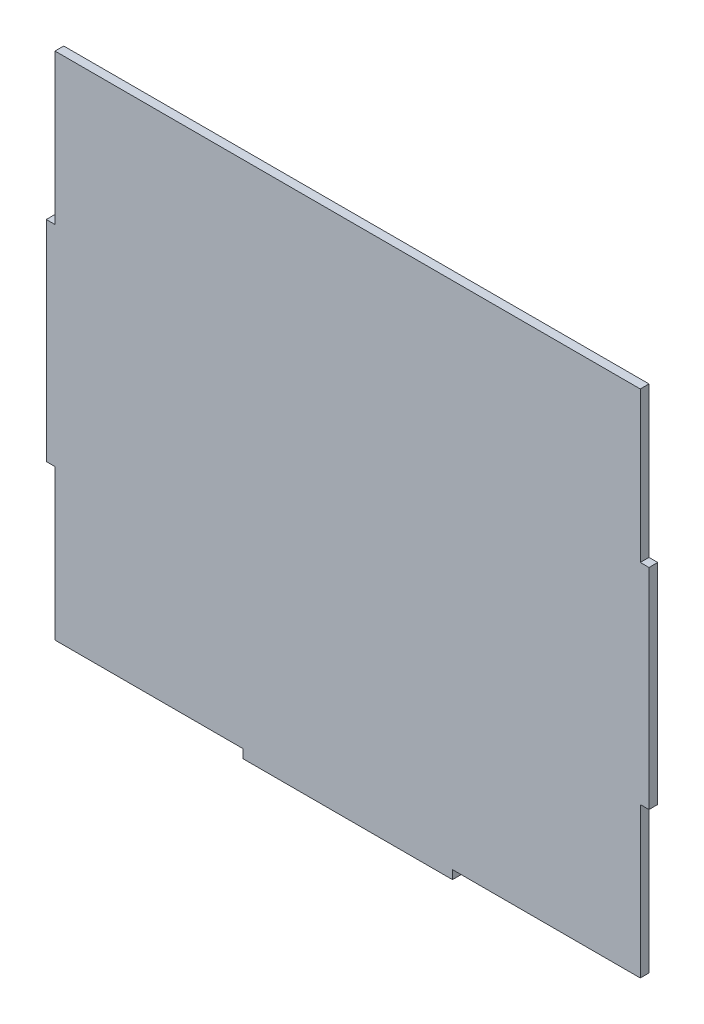
ISO-10303-21;
HEADER;
FILE_DESCRIPTION(('STEP AP214'),'2;1');
FILE_NAME('part.step','',(''),(''),'','','');
FILE_SCHEMA(('AUTOMOTIVE_DESIGN { 1 0 10303 214 1 1 1 1 }'));
ENDSEC;
DATA;
#1=APPLICATION_CONTEXT('core data for automotive mechanical design processes');
#2=APPLICATION_PROTOCOL_DEFINITION('international standard','automotive_design',2000,#1);
#3=PRODUCT_CONTEXT('',#1,'mechanical');
#4=PRODUCT('Part','Part','',(#3));
#5=PRODUCT_RELATED_PRODUCT_CATEGORY('part','',(#4));
#6=PRODUCT_DEFINITION_FORMATION('','',#4);
#7=PRODUCT_DEFINITION_CONTEXT('part definition',#1,'design');
#8=PRODUCT_DEFINITION('design','',#6,#7);
#9=PRODUCT_DEFINITION_SHAPE('','',#8);
#10=(LENGTH_UNIT() NAMED_UNIT(*) SI_UNIT(.MILLI.,.METRE.));
#11=(NAMED_UNIT(*) PLANE_ANGLE_UNIT() SI_UNIT($,.RADIAN.));
#12=(NAMED_UNIT(*) SI_UNIT($,.STERADIAN.) SOLID_ANGLE_UNIT());
#13=UNCERTAINTY_MEASURE_WITH_UNIT(LENGTH_MEASURE(1.E-05),#10,'distance_accuracy_value','');
#14=(GEOMETRIC_REPRESENTATION_CONTEXT(3) GLOBAL_UNCERTAINTY_ASSIGNED_CONTEXT((#13)) GLOBAL_UNIT_ASSIGNED_CONTEXT((#10,
#11,#12)) REPRESENTATION_CONTEXT('',''));
#15=CARTESIAN_POINT('',(0.,0.,0.));
#16=DIRECTION('',(0.,0.,1.));
#17=DIRECTION('',(1.,0.,0.));
#18=AXIS2_PLACEMENT_3D('',#15,#16,#17);
#19=CARTESIAN_POINT('',(-106.3625,-92.71,3.175));
#20=DIRECTION('',(0.,1.,0.));
#21=DIRECTION('',(0.,0.,1.));
#22=AXIS2_PLACEMENT_3D('',#19,#20,#21);
#23=PLANE('',#22);
#24=DIRECTION('',(0.,0.,-1.));
#25=VECTOR('',#24,1.);
#26=CARTESIAN_POINT('',(-38.1000000000002,-92.7099999999997,79.4411171490984));
#27=LINE('',#26,#25);
#28=CARTESIAN_POINT('',(-38.1000000000002,-92.7099999999997,3.175));
#29=VERTEX_POINT('',#28);
#30=CARTESIAN_POINT('',(-38.1000000000002,-92.7099999999997,0.));
#31=VERTEX_POINT('',#30);
#32=EDGE_CURVE('E176',#29,#31,#27,.T.);
#33=ORIENTED_EDGE('',*,*,#32,.F.);
#34=DIRECTION('',(1.,0.,0.));
#35=VECTOR('',#34,1.);
#36=CARTESIAN_POINT('',(-106.3625,-92.71,3.175));
#37=LINE('',#36,#35);
#38=CARTESIAN_POINT('',(-106.3625,-92.71,3.175));
#39=VERTEX_POINT('',#38);
#40=EDGE_CURVE('E241',#39,#29,#37,.T.);
#41=ORIENTED_EDGE('',*,*,#40,.F.);
#42=DIRECTION('',(0.,0.,-1.));
#43=VECTOR('',#42,1.);
#44=CARTESIAN_POINT('',(-106.3625,-92.71,3.175));
#45=LINE('',#44,#43);
#46=CARTESIAN_POINT('',(-106.3625,-92.71,0.));
#47=VERTEX_POINT('',#46);
#48=EDGE_CURVE('E259',#39,#47,#45,.T.);
#49=ORIENTED_EDGE('',*,*,#48,.T.);
#50=DIRECTION('',(1.,0.,0.));
#51=VECTOR('',#50,1.);
#52=CARTESIAN_POINT('',(-106.3625,-92.71,0.));
#53=LINE('',#52,#51);
#54=EDGE_CURVE('E254',#47,#31,#53,.T.);
#55=ORIENTED_EDGE('',*,*,#54,.T.);
#56=EDGE_LOOP('',(#33,#41,#49,#55));
#57=FACE_BOUND('',#56,.T.);
#58=ADVANCED_FACE('F34',(#57),#23,.F.);
#59=CARTESIAN_POINT('',(-106.3625,92.71,3.175));
#60=DIRECTION('',(1.,0.,0.));
#61=DIRECTION('',(0.,1.,0.));
#62=AXIS2_PLACEMENT_3D('',#59,#60,#61);
#63=PLANE('',#62);
#64=DIRECTION('',(0.,0.,-1.));
#65=VECTOR('',#64,1.);
#66=CARTESIAN_POINT('',(-106.3625,38.1,79.4411171490984));
#67=LINE('',#66,#65);
#68=CARTESIAN_POINT('',(-106.3625,38.1,3.175));
#69=VERTEX_POINT('',#68);
#70=CARTESIAN_POINT('',(-106.3625,38.1,0.));
#71=VERTEX_POINT('',#70);
#72=EDGE_CURVE('E194',#69,#71,#67,.T.);
#73=ORIENTED_EDGE('',*,*,#72,.F.);
#74=DIRECTION('',(0.,-1.,0.));
#75=VECTOR('',#74,1.);
#76=CARTESIAN_POINT('',(-106.3625,92.71,3.175));
#77=LINE('',#76,#75);
#78=CARTESIAN_POINT('',(-106.3625,92.71,3.175));
#79=VERTEX_POINT('',#78);
#80=EDGE_CURVE('E237',#79,#69,#77,.T.);
#81=ORIENTED_EDGE('',*,*,#80,.F.);
#82=DIRECTION('',(0.,0.,-1.));
#83=VECTOR('',#82,1.);
#84=CARTESIAN_POINT('',(-106.3625,92.71,3.175));
#85=LINE('',#84,#83);
#86=CARTESIAN_POINT('',(-106.3625,92.71,0.));
#87=VERTEX_POINT('',#86);
#88=EDGE_CURVE('E42',#79,#87,#85,.T.);
#89=ORIENTED_EDGE('',*,*,#88,.T.);
#90=DIRECTION('',(0.,-1.,0.));
#91=VECTOR('',#90,1.);
#92=CARTESIAN_POINT('',(-106.3625,92.71,0.));
#93=LINE('',#92,#91);
#94=EDGE_CURVE('E250',#87,#71,#93,.T.);
#95=ORIENTED_EDGE('',*,*,#94,.T.);
#96=EDGE_LOOP('',(#73,#81,#89,#95));
#97=FACE_BOUND('',#96,.T.);
#98=ADVANCED_FACE('F267',(#97),#63,.F.);
#99=CARTESIAN_POINT('',(106.3625,92.71,3.175));
#100=DIRECTION('',(-1.,0.,0.));
#101=DIRECTION('',(0.,-1.,0.));
#102=AXIS2_PLACEMENT_3D('',#99,#100,#101);
#103=PLANE('',#102);
#104=DIRECTION('',(0.,0.,-1.));
#105=VECTOR('',#104,1.);
#106=CARTESIAN_POINT('',(106.3625,-38.1,79.4411171490984));
#107=LINE('',#106,#105);
#108=CARTESIAN_POINT('',(106.3625,-38.1,3.175));
#109=VERTEX_POINT('',#108);
#110=CARTESIAN_POINT('',(106.3625,-38.1,0.));
#111=VERTEX_POINT('',#110);
#112=EDGE_CURVE('E215',#109,#111,#107,.T.);
#113=ORIENTED_EDGE('',*,*,#112,.F.);
#114=DIRECTION('',(0.,1.,0.));
#115=VECTOR('',#114,1.);
#116=CARTESIAN_POINT('',(106.3625,92.71,3.175));
#117=LINE('',#116,#115);
#118=CARTESIAN_POINT('',(106.3625,-92.71,3.175));
#119=VERTEX_POINT('',#118);
#120=EDGE_CURVE('E231',#119,#109,#117,.T.);
#121=ORIENTED_EDGE('',*,*,#120,.F.);
#122=DIRECTION('',(0.,0.,-1.));
#123=VECTOR('',#122,1.);
#124=CARTESIAN_POINT('',(106.3625,-92.71,3.175));
#125=LINE('',#124,#123);
#126=CARTESIAN_POINT('',(106.3625,-92.71,0.));
#127=VERTEX_POINT('',#126);
#128=EDGE_CURVE('E243',#119,#127,#125,.T.);
#129=ORIENTED_EDGE('',*,*,#128,.T.);
#130=DIRECTION('',(0.,1.,0.));
#131=VECTOR('',#130,1.);
#132=CARTESIAN_POINT('',(106.3625,92.71,0.));
#133=LINE('',#132,#131);
#134=EDGE_CURVE('E244',#127,#111,#133,.T.);
#135=ORIENTED_EDGE('',*,*,#134,.T.);
#136=EDGE_LOOP('',(#113,#121,#129,#135));
#137=FACE_BOUND('',#136,.T.);
#138=ADVANCED_FACE('F298',(#137),#103,.F.);
#139=CARTESIAN_POINT('',(106.3625,38.1,3.175));
#140=VERTEX_POINT('',#139);
#141=CARTESIAN_POINT('',(106.3625,92.71,3.175));
#142=VERTEX_POINT('',#141);
#143=EDGE_CURVE('E234',#140,#142,#117,.T.);
#144=ORIENTED_EDGE('',*,*,#143,.F.);
#145=DIRECTION('',(0.,0.,-1.));
#146=VECTOR('',#145,1.);
#147=CARTESIAN_POINT('',(106.3625,38.1,79.4411171490984));
#148=LINE('',#147,#146);
#149=CARTESIAN_POINT('',(106.3625,38.1,0.));
#150=VERTEX_POINT('',#149);
#151=EDGE_CURVE('E224',#140,#150,#148,.T.);
#152=ORIENTED_EDGE('',*,*,#151,.T.);
#153=CARTESIAN_POINT('',(106.3625,92.71,0.));
#154=VERTEX_POINT('',#153);
#155=EDGE_CURVE('E230',#150,#154,#133,.T.);
#156=ORIENTED_EDGE('',*,*,#155,.T.);
#157=DIRECTION('',(0.,0.,-1.));
#158=VECTOR('',#157,1.);
#159=CARTESIAN_POINT('',(106.3625,92.71,3.175));
#160=LINE('',#159,#158);
#161=EDGE_CURVE('E11',#142,#154,#160,.T.);
#162=ORIENTED_EDGE('',*,*,#161,.F.);
#163=EDGE_LOOP('',(#144,#152,#156,#162));
#164=FACE_BOUND('',#163,.T.);
#165=ADVANCED_FACE('F36',(#164),#103,.F.);
#166=CARTESIAN_POINT('',(-106.3625,92.71,3.175));
#167=DIRECTION('',(0.,-1.,0.));
#168=DIRECTION('',(0.,0.,-1.));
#169=AXIS2_PLACEMENT_3D('',#166,#167,#168);
#170=PLANE('',#169);
#171=DIRECTION('',(-1.,0.,0.));
#172=VECTOR('',#171,1.);
#173=CARTESIAN_POINT('',(-106.3625,92.71,0.));
#174=LINE('',#173,#172);
#175=EDGE_CURVE('E247',#154,#87,#174,.T.);
#176=ORIENTED_EDGE('',*,*,#175,.T.);
#177=ORIENTED_EDGE('',*,*,#88,.F.);
#178=DIRECTION('',(-1.,0.,0.));
#179=VECTOR('',#178,1.);
#180=CARTESIAN_POINT('',(-106.3625,92.71,3.175));
#181=LINE('',#180,#179);
#182=EDGE_CURVE('E233',#142,#79,#181,.T.);
#183=ORIENTED_EDGE('',*,*,#182,.F.);
#184=ORIENTED_EDGE('',*,*,#161,.T.);
#185=EDGE_LOOP('',(#176,#177,#183,#184));
#186=FACE_BOUND('',#185,.T.);
#187=ADVANCED_FACE('F282',(#186),#170,.F.);
#188=CARTESIAN_POINT('',(-106.3625,-38.1,3.175));
#189=VERTEX_POINT('',#188);
#190=EDGE_CURVE('E236',#189,#39,#77,.T.);
#191=ORIENTED_EDGE('',*,*,#190,.F.);
#192=DIRECTION('',(0.,0.,-1.));
#193=VECTOR('',#192,1.);
#194=CARTESIAN_POINT('',(-106.3625,-38.1,79.4411171490984));
#195=LINE('',#194,#193);
#196=CARTESIAN_POINT('',(-106.3625,-38.1,0.));
#197=VERTEX_POINT('',#196);
#198=EDGE_CURVE('E200',#189,#197,#195,.T.);
#199=ORIENTED_EDGE('',*,*,#198,.T.);
#200=EDGE_CURVE('E249',#197,#47,#93,.T.);
#201=ORIENTED_EDGE('',*,*,#200,.T.);
#202=ORIENTED_EDGE('',*,*,#48,.F.);
#203=EDGE_LOOP('',(#191,#199,#201,#202));
#204=FACE_BOUND('',#203,.T.);
#205=ADVANCED_FACE('F313',(#204),#63,.F.);
#206=CARTESIAN_POINT('',(38.0999999999998,-92.71,3.175));
#207=VERTEX_POINT('',#206);
#208=EDGE_CURVE('E240',#207,#119,#37,.T.);
#209=ORIENTED_EDGE('',*,*,#208,.F.);
#210=DIRECTION('',(0.,0.,-1.));
#211=VECTOR('',#210,1.);
#212=CARTESIAN_POINT('',(38.0999999999998,-92.71,79.4411171490984));
#213=LINE('',#212,#211);
#214=CARTESIAN_POINT('',(38.0999999999998,-92.71,0.));
#215=VERTEX_POINT('',#214);
#216=EDGE_CURVE('E167',#207,#215,#213,.T.);
#217=ORIENTED_EDGE('',*,*,#216,.T.);
#218=EDGE_CURVE('E253',#215,#127,#53,.T.);
#219=ORIENTED_EDGE('',*,*,#218,.T.);
#220=ORIENTED_EDGE('',*,*,#128,.F.);
#221=EDGE_LOOP('',(#209,#217,#219,#220));
#222=FACE_BOUND('',#221,.T.);
#223=ADVANCED_FACE('F302',(#222),#23,.F.);
#224=CARTESIAN_POINT('',(0.,0.,3.175));
#225=DIRECTION('',(0.,0.,1.));
#226=DIRECTION('',(1.,0.,0.));
#227=AXIS2_PLACEMENT_3D('',#224,#225,#226);
#228=PLANE('',#227);
#229=ORIENTED_EDGE('',*,*,#120,.T.);
#230=DIRECTION('',(-1.,0.,0.));
#231=VECTOR('',#230,1.);
#232=CARTESIAN_POINT('',(106.3625,-38.1,3.175));
#233=LINE('',#232,#231);
#234=CARTESIAN_POINT('',(109.5375,-38.1,3.175));
#235=VERTEX_POINT('',#234);
#236=EDGE_CURVE('E208',#235,#109,#233,.T.);
#237=ORIENTED_EDGE('',*,*,#236,.F.);
#238=DIRECTION('',(0.,-1.,0.));
#239=VECTOR('',#238,1.);
#240=CARTESIAN_POINT('',(109.5375,38.1,3.175));
#241=LINE('',#240,#239);
#242=CARTESIAN_POINT('',(109.5375,38.1,3.175));
#243=VERTEX_POINT('',#242);
#244=EDGE_CURVE('E216',#243,#235,#241,.T.);
#245=ORIENTED_EDGE('',*,*,#244,.F.);
#246=DIRECTION('',(1.,0.,0.));
#247=VECTOR('',#246,1.);
#248=CARTESIAN_POINT('',(106.3625,38.1,3.175));
#249=LINE('',#248,#247);
#250=EDGE_CURVE('E221',#140,#243,#249,.T.);
#251=ORIENTED_EDGE('',*,*,#250,.F.);
#252=ORIENTED_EDGE('',*,*,#143,.T.);
#253=ORIENTED_EDGE('',*,*,#182,.T.);
#254=ORIENTED_EDGE('',*,*,#80,.T.);
#255=DIRECTION('',(1.,0.,0.));
#256=VECTOR('',#255,1.);
#257=CARTESIAN_POINT('',(-106.3625,38.1,3.175));
#258=LINE('',#257,#256);
#259=CARTESIAN_POINT('',(-109.5375,38.1,3.175));
#260=VERTEX_POINT('',#259);
#261=EDGE_CURVE('E192',#260,#69,#258,.T.);
#262=ORIENTED_EDGE('',*,*,#261,.F.);
#263=DIRECTION('',(0.,1.,0.));
#264=VECTOR('',#263,1.);
#265=CARTESIAN_POINT('',(-109.5375,38.1,3.175));
#266=LINE('',#265,#264);
#267=CARTESIAN_POINT('',(-109.5375,-38.1,3.175));
#268=VERTEX_POINT('',#267);
#269=EDGE_CURVE('E196',#268,#260,#266,.T.);
#270=ORIENTED_EDGE('',*,*,#269,.F.);
#271=DIRECTION('',(-1.,0.,0.));
#272=VECTOR('',#271,1.);
#273=CARTESIAN_POINT('',(-106.3625,-38.1,3.175));
#274=LINE('',#273,#272);
#275=EDGE_CURVE('E184',#189,#268,#274,.T.);
#276=ORIENTED_EDGE('',*,*,#275,.F.);
#277=ORIENTED_EDGE('',*,*,#190,.T.);
#278=ORIENTED_EDGE('',*,*,#40,.T.);
#279=DIRECTION('',(0.,1.,0.));
#280=VECTOR('',#279,1.);
#281=CARTESIAN_POINT('',(-38.1000000000002,-95.8849999999997,3.175));
#282=LINE('',#281,#280);
#283=CARTESIAN_POINT('',(-38.1000000000002,-95.8849999999997,3.175));
#284=VERTEX_POINT('',#283);
#285=EDGE_CURVE('E155',#284,#29,#282,.T.);
#286=ORIENTED_EDGE('',*,*,#285,.F.);
#287=DIRECTION('',(-1.,0.,0.));
#288=VECTOR('',#287,1.);
#289=CARTESIAN_POINT('',(38.0999999999998,-95.885,3.175));
#290=LINE('',#289,#288);
#291=CARTESIAN_POINT('',(38.0999999999998,-95.885,3.175));
#292=VERTEX_POINT('',#291);
#293=EDGE_CURVE('E148',#292,#284,#290,.T.);
#294=ORIENTED_EDGE('',*,*,#293,.F.);
#295=DIRECTION('',(0.,-1.,0.));
#296=VECTOR('',#295,1.);
#297=CARTESIAN_POINT('',(38.0999999999998,-95.885,3.175));
#298=LINE('',#297,#296);
#299=EDGE_CURVE('E153',#207,#292,#298,.T.);
#300=ORIENTED_EDGE('',*,*,#299,.F.);
#301=ORIENTED_EDGE('',*,*,#208,.T.);
#302=EDGE_LOOP('',(#229,#237,#245,#251,#252,#253,#254,#262,#270,#276,#277,#278,#286,#294,#300,#301));
#303=FACE_BOUND('',#302,.T.);
#304=ADVANCED_FACE('F151',(#303),#228,.T.);
#305=CARTESIAN_POINT('',(0.,0.,0.));
#306=DIRECTION('',(0.,0.,1.));
#307=DIRECTION('',(1.,0.,0.));
#308=AXIS2_PLACEMENT_3D('',#305,#306,#307);
#309=PLANE('',#308);
#310=ORIENTED_EDGE('',*,*,#134,.F.);
#311=ORIENTED_EDGE('',*,*,#218,.F.);
#312=DIRECTION('',(0.,-1.,0.));
#313=VECTOR('',#312,1.);
#314=CARTESIAN_POINT('',(38.0999999999998,-95.885,0.));
#315=LINE('',#314,#313);
#316=CARTESIAN_POINT('',(38.0999999999998,-95.885,0.));
#317=VERTEX_POINT('',#316);
#318=EDGE_CURVE('E49',#215,#317,#315,.T.);
#319=ORIENTED_EDGE('',*,*,#318,.T.);
#320=DIRECTION('',(-1.,0.,0.));
#321=VECTOR('',#320,1.);
#322=CARTESIAN_POINT('',(38.0999999999998,-95.885,0.));
#323=LINE('',#322,#321);
#324=CARTESIAN_POINT('',(-38.1000000000002,-95.8849999999997,0.));
#325=VERTEX_POINT('',#324);
#326=EDGE_CURVE('E164',#317,#325,#323,.T.);
#327=ORIENTED_EDGE('',*,*,#326,.T.);
#328=DIRECTION('',(0.,1.,0.));
#329=VECTOR('',#328,1.);
#330=CARTESIAN_POINT('',(-38.1000000000002,-95.8849999999997,0.));
#331=LINE('',#330,#329);
#332=EDGE_CURVE('E169',#325,#31,#331,.T.);
#333=ORIENTED_EDGE('',*,*,#332,.T.);
#334=ORIENTED_EDGE('',*,*,#54,.F.);
#335=ORIENTED_EDGE('',*,*,#200,.F.);
#336=DIRECTION('',(-1.,0.,0.));
#337=VECTOR('',#336,1.);
#338=CARTESIAN_POINT('',(-106.3625,-38.1,0.));
#339=LINE('',#338,#337);
#340=CARTESIAN_POINT('',(-109.5375,-38.1,0.));
#341=VERTEX_POINT('',#340);
#342=EDGE_CURVE('E57',#197,#341,#339,.T.);
#343=ORIENTED_EDGE('',*,*,#342,.T.);
#344=DIRECTION('',(0.,1.,0.));
#345=VECTOR('',#344,1.);
#346=CARTESIAN_POINT('',(-109.5375,38.1,0.));
#347=LINE('',#346,#345);
#348=CARTESIAN_POINT('',(-109.5375,38.1,0.));
#349=VERTEX_POINT('',#348);
#350=EDGE_CURVE('E185',#341,#349,#347,.T.);
#351=ORIENTED_EDGE('',*,*,#350,.T.);
#352=DIRECTION('',(1.,0.,0.));
#353=VECTOR('',#352,1.);
#354=CARTESIAN_POINT('',(-106.3625,38.1,0.));
#355=LINE('',#354,#353);
#356=EDGE_CURVE('E181',#349,#71,#355,.T.);
#357=ORIENTED_EDGE('',*,*,#356,.T.);
#358=ORIENTED_EDGE('',*,*,#94,.F.);
#359=ORIENTED_EDGE('',*,*,#175,.F.);
#360=ORIENTED_EDGE('',*,*,#155,.F.);
#361=DIRECTION('',(1.,0.,0.));
#362=VECTOR('',#361,1.);
#363=CARTESIAN_POINT('',(106.3625,38.1,0.));
#364=LINE('',#363,#362);
#365=CARTESIAN_POINT('',(109.5375,38.1,0.));
#366=VERTEX_POINT('',#365);
#367=EDGE_CURVE('E205',#150,#366,#364,.T.);
#368=ORIENTED_EDGE('',*,*,#367,.T.);
#369=DIRECTION('',(0.,-1.,0.));
#370=VECTOR('',#369,1.);
#371=CARTESIAN_POINT('',(109.5375,38.1,0.));
#372=LINE('',#371,#370);
#373=CARTESIAN_POINT('',(109.5375,-38.1,0.));
#374=VERTEX_POINT('',#373);
#375=EDGE_CURVE('E204',#366,#374,#372,.T.);
#376=ORIENTED_EDGE('',*,*,#375,.T.);
#377=DIRECTION('',(-1.,0.,0.));
#378=VECTOR('',#377,1.);
#379=CARTESIAN_POINT('',(106.3625,-38.1,0.));
#380=LINE('',#379,#378);
#381=EDGE_CURVE('E209',#374,#111,#380,.T.);
#382=ORIENTED_EDGE('',*,*,#381,.T.);
#383=EDGE_LOOP('',(#310,#311,#319,#327,#333,#334,#335,#343,#351,#357,#358,#359,#360,#368,#376,#382));
#384=FACE_BOUND('',#383,.T.);
#385=ADVANCED_FACE('F273',(#384),#309,.F.);
#386=CARTESIAN_POINT('',(106.3625,-38.1,79.4411171490984));
#387=DIRECTION('',(0.,-1.,0.));
#388=DIRECTION('',(0.,0.,-1.));
#389=AXIS2_PLACEMENT_3D('',#386,#387,#388);
#390=PLANE('',#389);
#391=DIRECTION('',(0.,0.,-1.));
#392=VECTOR('',#391,1.);
#393=CARTESIAN_POINT('',(109.5375,-38.1,79.4411171490984));
#394=LINE('',#393,#392);
#395=EDGE_CURVE('E219',#235,#374,#394,.T.);
#396=ORIENTED_EDGE('',*,*,#395,.F.);
#397=ORIENTED_EDGE('',*,*,#236,.T.);
#398=ORIENTED_EDGE('',*,*,#112,.T.);
#399=ORIENTED_EDGE('',*,*,#381,.F.);
#400=EDGE_LOOP('',(#396,#397,#398,#399));
#401=FACE_BOUND('',#400,.T.);
#402=ADVANCED_FACE('F294',(#401),#390,.T.);
#403=CARTESIAN_POINT('',(106.3625,38.1,79.4411171490984));
#404=DIRECTION('',(0.,1.,0.));
#405=DIRECTION('',(0.,0.,1.));
#406=AXIS2_PLACEMENT_3D('',#403,#404,#405);
#407=PLANE('',#406);
#408=ORIENTED_EDGE('',*,*,#151,.F.);
#409=ORIENTED_EDGE('',*,*,#250,.T.);
#410=DIRECTION('',(0.,0.,-1.));
#411=VECTOR('',#410,1.);
#412=CARTESIAN_POINT('',(109.5375,38.1,79.4411171490984));
#413=LINE('',#412,#411);
#414=EDGE_CURVE('E220',#243,#366,#413,.T.);
#415=ORIENTED_EDGE('',*,*,#414,.T.);
#416=ORIENTED_EDGE('',*,*,#367,.F.);
#417=EDGE_LOOP('',(#408,#409,#415,#416));
#418=FACE_BOUND('',#417,.T.);
#419=ADVANCED_FACE('F287',(#418),#407,.T.);
#420=CARTESIAN_POINT('',(109.5375,38.1,79.4411171490984));
#421=DIRECTION('',(1.,0.,0.));
#422=DIRECTION('',(0.,0.,-1.));
#423=AXIS2_PLACEMENT_3D('',#420,#421,#422);
#424=PLANE('',#423);
#425=ORIENTED_EDGE('',*,*,#414,.F.);
#426=ORIENTED_EDGE('',*,*,#244,.T.);
#427=ORIENTED_EDGE('',*,*,#395,.T.);
#428=ORIENTED_EDGE('',*,*,#375,.F.);
#429=EDGE_LOOP('',(#425,#426,#427,#428));
#430=FACE_BOUND('',#429,.T.);
#431=ADVANCED_FACE('F290',(#430),#424,.T.);
#432=CARTESIAN_POINT('',(-106.3625,-38.1,79.4411171490984));
#433=DIRECTION('',(0.,-1.,0.));
#434=DIRECTION('',(0.,0.,-1.));
#435=AXIS2_PLACEMENT_3D('',#432,#433,#434);
#436=PLANE('',#435);
#437=ORIENTED_EDGE('',*,*,#198,.F.);
#438=ORIENTED_EDGE('',*,*,#275,.T.);
#439=DIRECTION('',(0.,0.,-1.));
#440=VECTOR('',#439,1.);
#441=CARTESIAN_POINT('',(-109.5375,-38.1,79.4411171490984));
#442=LINE('',#441,#440);
#443=EDGE_CURVE('E191',#268,#341,#442,.T.);
#444=ORIENTED_EDGE('',*,*,#443,.T.);
#445=ORIENTED_EDGE('',*,*,#342,.F.);
#446=EDGE_LOOP('',(#437,#438,#444,#445));
#447=FACE_BOUND('',#446,.T.);
#448=ADVANCED_FACE('F315',(#447),#436,.T.);
#449=CARTESIAN_POINT('',(-109.5375,38.1,79.4411171490984));
#450=DIRECTION('',(-1.,0.,0.));
#451=DIRECTION('',(0.,0.,1.));
#452=AXIS2_PLACEMENT_3D('',#449,#450,#451);
#453=PLANE('',#452);
#454=ORIENTED_EDGE('',*,*,#443,.F.);
#455=ORIENTED_EDGE('',*,*,#269,.T.);
#456=DIRECTION('',(0.,0.,-1.));
#457=VECTOR('',#456,1.);
#458=CARTESIAN_POINT('',(-109.5375,38.1,79.4411171490984));
#459=LINE('',#458,#457);
#460=EDGE_CURVE('E195',#260,#349,#459,.T.);
#461=ORIENTED_EDGE('',*,*,#460,.T.);
#462=ORIENTED_EDGE('',*,*,#350,.F.);
#463=EDGE_LOOP('',(#454,#455,#461,#462));
#464=FACE_BOUND('',#463,.T.);
#465=ADVANCED_FACE('F318',(#464),#453,.T.);
#466=CARTESIAN_POINT('',(-106.3625,38.1,79.4411171490984));
#467=DIRECTION('',(0.,1.,0.));
#468=DIRECTION('',(0.,0.,1.));
#469=AXIS2_PLACEMENT_3D('',#466,#467,#468);
#470=PLANE('',#469);
#471=ORIENTED_EDGE('',*,*,#460,.F.);
#472=ORIENTED_EDGE('',*,*,#261,.T.);
#473=ORIENTED_EDGE('',*,*,#72,.T.);
#474=ORIENTED_EDGE('',*,*,#356,.F.);
#475=EDGE_LOOP('',(#471,#472,#473,#474));
#476=FACE_BOUND('',#475,.T.);
#477=ADVANCED_FACE('F279',(#476),#470,.T.);
#478=CARTESIAN_POINT('',(38.0999999999998,-95.885,79.4411171490984));
#479=DIRECTION('',(1.,0.,0.));
#480=DIRECTION('',(0.,0.,-1.));
#481=AXIS2_PLACEMENT_3D('',#478,#479,#480);
#482=PLANE('',#481);
#483=ORIENTED_EDGE('',*,*,#216,.F.);
#484=ORIENTED_EDGE('',*,*,#299,.T.);
#485=DIRECTION('',(0.,0.,-1.));
#486=VECTOR('',#485,1.);
#487=CARTESIAN_POINT('',(38.0999999999998,-95.885,79.4411171490984));
#488=LINE('',#487,#486);
#489=EDGE_CURVE('E159',#292,#317,#488,.T.);
#490=ORIENTED_EDGE('',*,*,#489,.T.);
#491=ORIENTED_EDGE('',*,*,#318,.F.);
#492=EDGE_LOOP('',(#483,#484,#490,#491));
#493=FACE_BOUND('',#492,.T.);
#494=ADVANCED_FACE('F166',(#493),#482,.T.);
#495=CARTESIAN_POINT('',(38.0999999999998,-95.885,79.4411171490984));
#496=DIRECTION('',(0.,-1.,0.));
#497=DIRECTION('',(1.,0.,0.));
#498=AXIS2_PLACEMENT_3D('',#495,#496,#497);
#499=PLANE('',#498);
#500=ORIENTED_EDGE('',*,*,#489,.F.);
#501=ORIENTED_EDGE('',*,*,#293,.T.);
#502=DIRECTION('',(0.,0.,-1.));
#503=VECTOR('',#502,1.);
#504=CARTESIAN_POINT('',(-38.1000000000002,-95.8849999999997,79.4411171490984));
#505=LINE('',#504,#503);
#506=EDGE_CURVE('E158',#284,#325,#505,.T.);
#507=ORIENTED_EDGE('',*,*,#506,.T.);
#508=ORIENTED_EDGE('',*,*,#326,.F.);
#509=EDGE_LOOP('',(#500,#501,#507,#508));
#510=FACE_BOUND('',#509,.T.);
#511=ADVANCED_FACE('F162',(#510),#499,.T.);
#512=CARTESIAN_POINT('',(-38.1000000000002,-95.8849999999997,79.4411171490984));
#513=DIRECTION('',(-1.,0.,0.));
#514=DIRECTION('',(0.,-1.,0.));
#515=AXIS2_PLACEMENT_3D('',#512,#513,#514);
#516=PLANE('',#515);
#517=ORIENTED_EDGE('',*,*,#506,.F.);
#518=ORIENTED_EDGE('',*,*,#285,.T.);
#519=ORIENTED_EDGE('',*,*,#32,.T.);
#520=ORIENTED_EDGE('',*,*,#332,.F.);
#521=EDGE_LOOP('',(#517,#518,#519,#520));
#522=FACE_BOUND('',#521,.T.);
#523=ADVANCED_FACE('F306',(#522),#516,.T.);
#524=CLOSED_SHELL('',(#58,#98,#138,#165,#187,#205,#223,#304,#385,#402,#419,#431,#448,#465,#477,
#494,#511,#523));
#525=MANIFOLD_SOLID_BREP('B2',#524);
#526=ADVANCED_BREP_SHAPE_REPRESENTATION('',(#18,#525),#14);
#527=SHAPE_DEFINITION_REPRESENTATION(#9,#526);
ENDSEC;
END-ISO-10303-21;
